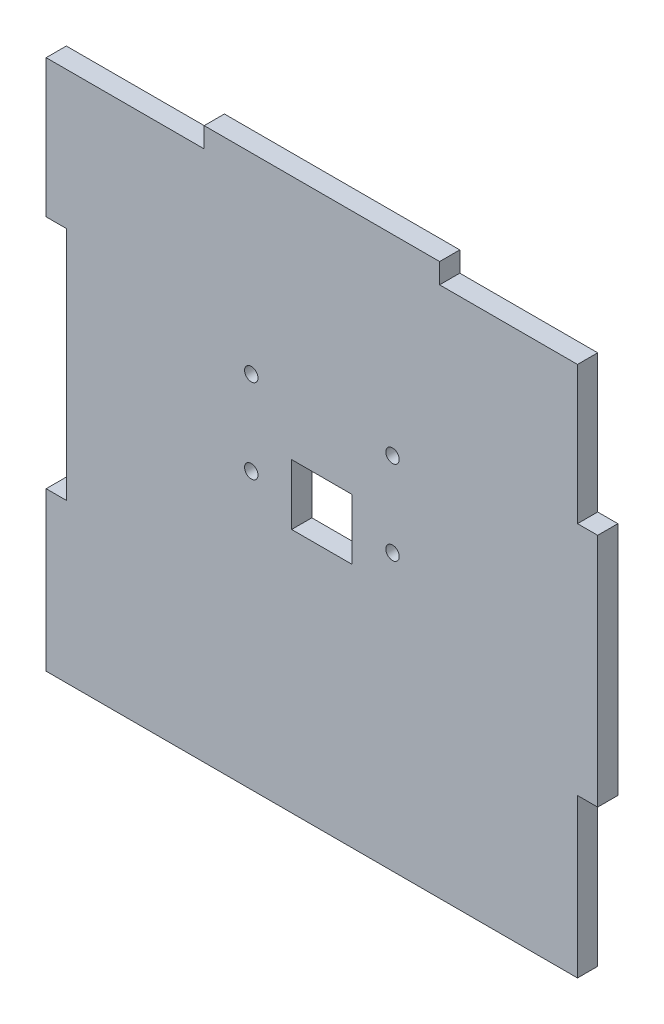
ISO-10303-21;
HEADER;
FILE_DESCRIPTION(('STEP AP214'),'2;1');
FILE_NAME('part.step','',(''),(''),'','','');
FILE_SCHEMA(('AUTOMOTIVE_DESIGN { 1 0 10303 214 1 1 1 1 }'));
ENDSEC;
DATA;
#1=APPLICATION_CONTEXT('core data for automotive mechanical design processes');
#2=APPLICATION_PROTOCOL_DEFINITION('international standard','automotive_design',2000,#1);
#3=PRODUCT_CONTEXT('',#1,'mechanical');
#4=PRODUCT('Part','Part','',(#3));
#5=PRODUCT_RELATED_PRODUCT_CATEGORY('part','',(#4));
#6=PRODUCT_DEFINITION_FORMATION('','',#4);
#7=PRODUCT_DEFINITION_CONTEXT('part definition',#1,'design');
#8=PRODUCT_DEFINITION('design','',#6,#7);
#9=PRODUCT_DEFINITION_SHAPE('','',#8);
#10=(LENGTH_UNIT() NAMED_UNIT(*) SI_UNIT(.MILLI.,.METRE.));
#11=(NAMED_UNIT(*) PLANE_ANGLE_UNIT() SI_UNIT($,.RADIAN.));
#12=(NAMED_UNIT(*) SI_UNIT($,.STERADIAN.) SOLID_ANGLE_UNIT());
#13=UNCERTAINTY_MEASURE_WITH_UNIT(LENGTH_MEASURE(1.E-05),#10,'distance_accuracy_value','');
#14=(GEOMETRIC_REPRESENTATION_CONTEXT(3) GLOBAL_UNCERTAINTY_ASSIGNED_CONTEXT((#13)) GLOBAL_UNIT_ASSIGNED_CONTEXT((#10,
#11,#12)) REPRESENTATION_CONTEXT('',''));
#15=CARTESIAN_POINT('',(0.,0.,0.));
#16=DIRECTION('',(0.,0.,1.));
#17=DIRECTION('',(1.,0.,0.));
#18=AXIS2_PLACEMENT_3D('',#15,#16,#17);
#19=CARTESIAN_POINT('',(38.,-16.,3.));
#20=DIRECTION('',(0.,1.,0.));
#21=DIRECTION('',(-1.,0.,0.));
#22=AXIS2_PLACEMENT_3D('',#19,#20,#21);
#23=PLANE('',#22);
#24=DIRECTION('',(1.,0.,0.));
#25=VECTOR('',#24,1.);
#26=CARTESIAN_POINT('',(38.,-16.,0.));
#27=LINE('',#26,#25);
#28=CARTESIAN_POINT('',(38.,-16.,0.));
#29=VERTEX_POINT('',#28);
#30=CARTESIAN_POINT('',(41.,-16.,0.));
#31=VERTEX_POINT('',#30);
#32=EDGE_CURVE('E246',#29,#31,#27,.T.);
#33=ORIENTED_EDGE('',*,*,#32,.T.);
#34=DIRECTION('',(0.,0.,-1.));
#35=VECTOR('',#34,1.);
#36=CARTESIAN_POINT('',(41.,-16.,3.));
#37=LINE('',#36,#35);
#38=CARTESIAN_POINT('',(41.,-16.,3.));
#39=VERTEX_POINT('',#38);
#40=EDGE_CURVE('E11',#39,#31,#37,.T.);
#41=ORIENTED_EDGE('',*,*,#40,.F.);
#42=DIRECTION('',(1.,0.,0.));
#43=VECTOR('',#42,1.);
#44=CARTESIAN_POINT('',(38.,-16.,3.));
#45=LINE('',#44,#43);
#46=CARTESIAN_POINT('',(38.,-16.,3.));
#47=VERTEX_POINT('',#46);
#48=EDGE_CURVE('E252',#47,#39,#45,.T.);
#49=ORIENTED_EDGE('',*,*,#48,.F.);
#50=DIRECTION('',(0.,0.,-1.));
#51=VECTOR('',#50,1.);
#52=CARTESIAN_POINT('',(38.,-16.,3.));
#53=LINE('',#52,#51);
#54=EDGE_CURVE('E302',#47,#29,#53,.T.);
#55=ORIENTED_EDGE('',*,*,#54,.T.);
#56=EDGE_LOOP('',(#33,#41,#49,#55));
#57=FACE_BOUND('',#56,.T.);
#58=ADVANCED_FACE('F38',(#57),#23,.F.);
#59=CARTESIAN_POINT('',(41.,16.,3.));
#60=DIRECTION('',(-1.,0.,0.));
#61=DIRECTION('',(0.,0.,1.));
#62=AXIS2_PLACEMENT_3D('',#59,#60,#61);
#63=PLANE('',#62);
#64=DIRECTION('',(0.,1.,0.));
#65=VECTOR('',#64,1.);
#66=CARTESIAN_POINT('',(41.,16.,0.));
#67=LINE('',#66,#65);
#68=CARTESIAN_POINT('',(41.,19.,0.));
#69=VERTEX_POINT('',#68);
#70=EDGE_CURVE('E306',#31,#69,#67,.T.);
#71=ORIENTED_EDGE('',*,*,#70,.T.);
#72=DIRECTION('',(0.,0.,-1.));
#73=VECTOR('',#72,1.);
#74=CARTESIAN_POINT('',(41.,19.,3.));
#75=LINE('',#74,#73);
#76=CARTESIAN_POINT('',(41.,19.,3.));
#77=VERTEX_POINT('',#76);
#78=EDGE_CURVE('E46',#77,#69,#75,.T.);
#79=ORIENTED_EDGE('',*,*,#78,.F.);
#80=DIRECTION('',(0.,1.,0.));
#81=VECTOR('',#80,1.);
#82=CARTESIAN_POINT('',(41.,16.,3.));
#83=LINE('',#82,#81);
#84=EDGE_CURVE('E256',#39,#77,#83,.T.);
#85=ORIENTED_EDGE('',*,*,#84,.F.);
#86=ORIENTED_EDGE('',*,*,#40,.T.);
#87=EDGE_LOOP('',(#71,#79,#85,#86));
#88=FACE_BOUND('',#87,.T.);
#89=ADVANCED_FACE('F436',(#88),#63,.F.);
#90=CARTESIAN_POINT('',(41.,19.,3.));
#91=DIRECTION('',(0.,-1.,0.));
#92=DIRECTION('',(0.,0.,-1.));
#93=AXIS2_PLACEMENT_3D('',#90,#91,#92);
#94=PLANE('',#93);
#95=DIRECTION('',(-1.,0.,0.));
#96=VECTOR('',#95,1.);
#97=CARTESIAN_POINT('',(41.,19.,0.));
#98=LINE('',#97,#96);
#99=CARTESIAN_POINT('',(38.,19.,0.));
#100=VERTEX_POINT('',#99);
#101=EDGE_CURVE('E309',#69,#100,#98,.T.);
#102=ORIENTED_EDGE('',*,*,#101,.T.);
#103=DIRECTION('',(0.,0.,-1.));
#104=VECTOR('',#103,1.);
#105=CARTESIAN_POINT('',(38.,19.,3.));
#106=LINE('',#105,#104);
#107=CARTESIAN_POINT('',(38.,19.,3.));
#108=VERTEX_POINT('',#107);
#109=EDGE_CURVE('E405',#108,#100,#106,.T.);
#110=ORIENTED_EDGE('',*,*,#109,.F.);
#111=DIRECTION('',(-1.,0.,0.));
#112=VECTOR('',#111,1.);
#113=CARTESIAN_POINT('',(41.,19.,3.));
#114=LINE('',#113,#112);
#115=EDGE_CURVE('E260',#77,#108,#114,.T.);
#116=ORIENTED_EDGE('',*,*,#115,.F.);
#117=ORIENTED_EDGE('',*,*,#78,.T.);
#118=EDGE_LOOP('',(#102,#110,#116,#117));
#119=FACE_BOUND('',#118,.T.);
#120=ADVANCED_FACE('F414',(#119),#94,.F.);
#121=CARTESIAN_POINT('',(38.,39.5,3.));
#122=DIRECTION('',(-1.,0.,0.));
#123=DIRECTION('',(0.,-1.,0.));
#124=AXIS2_PLACEMENT_3D('',#121,#122,#123);
#125=PLANE('',#124);
#126=DIRECTION('',(0.,1.,0.));
#127=VECTOR('',#126,1.);
#128=CARTESIAN_POINT('',(38.,39.5,0.));
#129=LINE('',#128,#127);
#130=CARTESIAN_POINT('',(38.,39.5,0.));
#131=VERTEX_POINT('',#130);
#132=EDGE_CURVE('E312',#100,#131,#129,.T.);
#133=ORIENTED_EDGE('',*,*,#132,.T.);
#134=DIRECTION('',(0.,0.,-1.));
#135=VECTOR('',#134,1.);
#136=CARTESIAN_POINT('',(38.,39.5,3.));
#137=LINE('',#136,#135);
#138=CARTESIAN_POINT('',(38.,39.5,3.));
#139=VERTEX_POINT('',#138);
#140=EDGE_CURVE('E401',#139,#131,#137,.T.);
#141=ORIENTED_EDGE('',*,*,#140,.F.);
#142=DIRECTION('',(0.,1.,0.));
#143=VECTOR('',#142,1.);
#144=CARTESIAN_POINT('',(38.,39.5,3.));
#145=LINE('',#144,#143);
#146=EDGE_CURVE('E263',#108,#139,#145,.T.);
#147=ORIENTED_EDGE('',*,*,#146,.F.);
#148=ORIENTED_EDGE('',*,*,#109,.T.);
#149=EDGE_LOOP('',(#133,#141,#147,#148));
#150=FACE_BOUND('',#149,.T.);
#151=ADVANCED_FACE('F424',(#150),#125,.F.);
#152=CARTESIAN_POINT('',(17.5,39.5,3.));
#153=DIRECTION('',(0.,-1.,0.));
#154=DIRECTION('',(1.,0.,0.));
#155=AXIS2_PLACEMENT_3D('',#152,#153,#154);
#156=PLANE('',#155);
#157=DIRECTION('',(-1.,0.,0.));
#158=VECTOR('',#157,1.);
#159=CARTESIAN_POINT('',(17.5,39.5,0.));
#160=LINE('',#159,#158);
#161=CARTESIAN_POINT('',(17.5,39.5,0.));
#162=VERTEX_POINT('',#161);
#163=EDGE_CURVE('E315',#131,#162,#160,.T.);
#164=ORIENTED_EDGE('',*,*,#163,.T.);
#165=DIRECTION('',(0.,0.,-1.));
#166=VECTOR('',#165,1.);
#167=CARTESIAN_POINT('',(17.5,39.5,3.));
#168=LINE('',#167,#166);
#169=CARTESIAN_POINT('',(17.5,39.5,3.));
#170=VERTEX_POINT('',#169);
#171=EDGE_CURVE('E397',#170,#162,#168,.T.);
#172=ORIENTED_EDGE('',*,*,#171,.F.);
#173=DIRECTION('',(-1.,0.,0.));
#174=VECTOR('',#173,1.);
#175=CARTESIAN_POINT('',(17.5,39.5,3.));
#176=LINE('',#175,#174);
#177=EDGE_CURVE('E266',#139,#170,#176,.T.);
#178=ORIENTED_EDGE('',*,*,#177,.F.);
#179=ORIENTED_EDGE('',*,*,#140,.T.);
#180=EDGE_LOOP('',(#164,#172,#178,#179));
#181=FACE_BOUND('',#180,.T.);
#182=ADVANCED_FACE('F428',(#181),#156,.F.);
#183=CARTESIAN_POINT('',(17.5,42.5,3.));
#184=DIRECTION('',(-1.,0.,0.));
#185=DIRECTION('',(0.,-1.,0.));
#186=AXIS2_PLACEMENT_3D('',#183,#184,#185);
#187=PLANE('',#186);
#188=DIRECTION('',(0.,1.,0.));
#189=VECTOR('',#188,1.);
#190=CARTESIAN_POINT('',(17.5,42.5,0.));
#191=LINE('',#190,#189);
#192=CARTESIAN_POINT('',(17.5,42.5,0.));
#193=VERTEX_POINT('',#192);
#194=EDGE_CURVE('E318',#162,#193,#191,.T.);
#195=ORIENTED_EDGE('',*,*,#194,.T.);
#196=DIRECTION('',(0.,0.,-1.));
#197=VECTOR('',#196,1.);
#198=CARTESIAN_POINT('',(17.5,42.5,3.));
#199=LINE('',#198,#197);
#200=CARTESIAN_POINT('',(17.5,42.5,3.));
#201=VERTEX_POINT('',#200);
#202=EDGE_CURVE('E393',#201,#193,#199,.T.);
#203=ORIENTED_EDGE('',*,*,#202,.F.);
#204=DIRECTION('',(0.,1.,0.));
#205=VECTOR('',#204,1.);
#206=CARTESIAN_POINT('',(17.5,42.5,3.));
#207=LINE('',#206,#205);
#208=EDGE_CURVE('E269',#170,#201,#207,.T.);
#209=ORIENTED_EDGE('',*,*,#208,.F.);
#210=ORIENTED_EDGE('',*,*,#171,.T.);
#211=EDGE_LOOP('',(#195,#203,#209,#210));
#212=FACE_BOUND('',#211,.T.);
#213=ADVANCED_FACE('F485',(#212),#187,.F.);
#214=CARTESIAN_POINT('',(-17.5,42.5,3.));
#215=DIRECTION('',(0.,-1.,0.));
#216=DIRECTION('',(0.,0.,-1.));
#217=AXIS2_PLACEMENT_3D('',#214,#215,#216);
#218=PLANE('',#217);
#219=DIRECTION('',(-1.,0.,0.));
#220=VECTOR('',#219,1.);
#221=CARTESIAN_POINT('',(-17.5,42.5,0.));
#222=LINE('',#221,#220);
#223=CARTESIAN_POINT('',(-17.5,42.5,0.));
#224=VERTEX_POINT('',#223);
#225=EDGE_CURVE('E321',#193,#224,#222,.T.);
#226=ORIENTED_EDGE('',*,*,#225,.T.);
#227=DIRECTION('',(0.,0.,-1.));
#228=VECTOR('',#227,1.);
#229=CARTESIAN_POINT('',(-17.5,42.5,3.));
#230=LINE('',#229,#228);
#231=CARTESIAN_POINT('',(-17.5,42.5,3.));
#232=VERTEX_POINT('',#231);
#233=EDGE_CURVE('E389',#232,#224,#230,.T.);
#234=ORIENTED_EDGE('',*,*,#233,.F.);
#235=DIRECTION('',(-1.,0.,0.));
#236=VECTOR('',#235,1.);
#237=CARTESIAN_POINT('',(-17.5,42.5,3.));
#238=LINE('',#237,#236);
#239=EDGE_CURVE('E272',#201,#232,#238,.T.);
#240=ORIENTED_EDGE('',*,*,#239,.F.);
#241=ORIENTED_EDGE('',*,*,#202,.T.);
#242=EDGE_LOOP('',(#226,#234,#240,#241));
#243=FACE_BOUND('',#242,.T.);
#244=ADVANCED_FACE('F483',(#243),#218,.F.);
#245=CARTESIAN_POINT('',(-17.5,39.5,3.));
#246=DIRECTION('',(1.,0.,0.));
#247=DIRECTION('',(0.,0.,-1.));
#248=AXIS2_PLACEMENT_3D('',#245,#246,#247);
#249=PLANE('',#248);
#250=DIRECTION('',(0.,-1.,0.));
#251=VECTOR('',#250,1.);
#252=CARTESIAN_POINT('',(-17.5,39.5,0.));
#253=LINE('',#252,#251);
#254=CARTESIAN_POINT('',(-17.5,39.5,0.));
#255=VERTEX_POINT('',#254);
#256=EDGE_CURVE('E324',#224,#255,#253,.T.);
#257=ORIENTED_EDGE('',*,*,#256,.T.);
#258=DIRECTION('',(0.,0.,-1.));
#259=VECTOR('',#258,1.);
#260=CARTESIAN_POINT('',(-17.5,39.5,3.));
#261=LINE('',#260,#259);
#262=CARTESIAN_POINT('',(-17.5,39.5,3.));
#263=VERTEX_POINT('',#262);
#264=EDGE_CURVE('E385',#263,#255,#261,.T.);
#265=ORIENTED_EDGE('',*,*,#264,.F.);
#266=DIRECTION('',(0.,-1.,0.));
#267=VECTOR('',#266,1.);
#268=CARTESIAN_POINT('',(-17.5,39.5,3.));
#269=LINE('',#268,#267);
#270=EDGE_CURVE('E275',#232,#263,#269,.T.);
#271=ORIENTED_EDGE('',*,*,#270,.F.);
#272=ORIENTED_EDGE('',*,*,#233,.T.);
#273=EDGE_LOOP('',(#257,#265,#271,#272));
#274=FACE_BOUND('',#273,.T.);
#275=ADVANCED_FACE('F476',(#274),#249,.F.);
#276=CARTESIAN_POINT('',(-41.,39.5,3.));
#277=DIRECTION('',(0.,-1.,0.));
#278=DIRECTION('',(0.,0.,-1.));
#279=AXIS2_PLACEMENT_3D('',#276,#277,#278);
#280=PLANE('',#279);
#281=DIRECTION('',(-1.,0.,0.));
#282=VECTOR('',#281,1.);
#283=CARTESIAN_POINT('',(-41.,39.5,0.));
#284=LINE('',#283,#282);
#285=CARTESIAN_POINT('',(-41.,39.5,0.));
#286=VERTEX_POINT('',#285);
#287=EDGE_CURVE('E328',#255,#286,#284,.T.);
#288=ORIENTED_EDGE('',*,*,#287,.T.);
#289=DIRECTION('',(0.,0.,-1.));
#290=VECTOR('',#289,1.);
#291=CARTESIAN_POINT('',(-41.,39.5,3.));
#292=LINE('',#291,#290);
#293=CARTESIAN_POINT('',(-41.,39.5,3.));
#294=VERTEX_POINT('',#293);
#295=EDGE_CURVE('E381',#294,#286,#292,.T.);
#296=ORIENTED_EDGE('',*,*,#295,.F.);
#297=DIRECTION('',(-1.,0.,0.));
#298=VECTOR('',#297,1.);
#299=CARTESIAN_POINT('',(-38.,39.5,3.));
#300=LINE('',#299,#298);
#301=EDGE_CURVE('E278',#263,#294,#300,.T.);
#302=ORIENTED_EDGE('',*,*,#301,.F.);
#303=ORIENTED_EDGE('',*,*,#264,.T.);
#304=EDGE_LOOP('',(#288,#296,#302,#303));
#305=FACE_BOUND('',#304,.T.);
#306=ADVANCED_FACE('F480',(#305),#280,.F.);
#307=CARTESIAN_POINT('',(-41.,19.,3.));
#308=DIRECTION('',(1.,0.,0.));
#309=DIRECTION('',(0.,1.,0.));
#310=AXIS2_PLACEMENT_3D('',#307,#308,#309);
#311=PLANE('',#310);
#312=DIRECTION('',(0.,-1.,0.));
#313=VECTOR('',#312,1.);
#314=CARTESIAN_POINT('',(-41.,19.,0.));
#315=LINE('',#314,#313);
#316=CARTESIAN_POINT('',(-41.,19.,0.));
#317=VERTEX_POINT('',#316);
#318=EDGE_CURVE('E331',#286,#317,#315,.T.);
#319=ORIENTED_EDGE('',*,*,#318,.T.);
#320=DIRECTION('',(0.,0.,-1.));
#321=VECTOR('',#320,1.);
#322=CARTESIAN_POINT('',(-41.,19.,3.));
#323=LINE('',#322,#321);
#324=CARTESIAN_POINT('',(-41.,19.,3.));
#325=VERTEX_POINT('',#324);
#326=EDGE_CURVE('E377',#325,#317,#323,.T.);
#327=ORIENTED_EDGE('',*,*,#326,.F.);
#328=DIRECTION('',(0.,-1.,0.));
#329=VECTOR('',#328,1.);
#330=CARTESIAN_POINT('',(-41.,19.,3.));
#331=LINE('',#330,#329);
#332=EDGE_CURVE('E281',#294,#325,#331,.T.);
#333=ORIENTED_EDGE('',*,*,#332,.F.);
#334=ORIENTED_EDGE('',*,*,#295,.T.);
#335=EDGE_LOOP('',(#319,#327,#333,#334));
#336=FACE_BOUND('',#335,.T.);
#337=ADVANCED_FACE('F469',(#336),#311,.F.);
#338=CARTESIAN_POINT('',(-38.,19.,3.));
#339=DIRECTION('',(0.,1.,0.));
#340=DIRECTION('',(-1.,0.,0.));
#341=AXIS2_PLACEMENT_3D('',#338,#339,#340);
#342=PLANE('',#341);
#343=DIRECTION('',(1.,0.,0.));
#344=VECTOR('',#343,1.);
#345=CARTESIAN_POINT('',(-38.,19.,0.));
#346=LINE('',#345,#344);
#347=CARTESIAN_POINT('',(-38.,19.,0.));
#348=VERTEX_POINT('',#347);
#349=EDGE_CURVE('E334',#317,#348,#346,.T.);
#350=ORIENTED_EDGE('',*,*,#349,.T.);
#351=DIRECTION('',(0.,0.,-1.));
#352=VECTOR('',#351,1.);
#353=CARTESIAN_POINT('',(-38.,19.,3.));
#354=LINE('',#353,#352);
#355=CARTESIAN_POINT('',(-38.,19.,3.));
#356=VERTEX_POINT('',#355);
#357=EDGE_CURVE('E373',#356,#348,#354,.T.);
#358=ORIENTED_EDGE('',*,*,#357,.F.);
#359=DIRECTION('',(1.,0.,0.));
#360=VECTOR('',#359,1.);
#361=CARTESIAN_POINT('',(-38.,19.,3.));
#362=LINE('',#361,#360);
#363=EDGE_CURVE('E284',#325,#356,#362,.T.);
#364=ORIENTED_EDGE('',*,*,#363,.F.);
#365=ORIENTED_EDGE('',*,*,#326,.T.);
#366=EDGE_LOOP('',(#350,#358,#364,#365));
#367=FACE_BOUND('',#366,.T.);
#368=ADVANCED_FACE('F464',(#367),#342,.F.);
#369=CARTESIAN_POINT('',(-38.,16.,3.));
#370=DIRECTION('',(1.,0.,0.));
#371=DIRECTION('',(0.,0.,-1.));
#372=AXIS2_PLACEMENT_3D('',#369,#370,#371);
#373=PLANE('',#372);
#374=DIRECTION('',(0.,-1.,0.));
#375=VECTOR('',#374,1.);
#376=CARTESIAN_POINT('',(-38.,16.,0.));
#377=LINE('',#376,#375);
#378=CARTESIAN_POINT('',(-38.,-16.,0.));
#379=VERTEX_POINT('',#378);
#380=EDGE_CURVE('E338',#348,#379,#377,.T.);
#381=ORIENTED_EDGE('',*,*,#380,.T.);
#382=DIRECTION('',(0.,0.,-1.));
#383=VECTOR('',#382,1.);
#384=CARTESIAN_POINT('',(-38.,-16.,3.));
#385=LINE('',#384,#383);
#386=CARTESIAN_POINT('',(-38.,-16.,3.));
#387=VERTEX_POINT('',#386);
#388=EDGE_CURVE('E369',#387,#379,#385,.T.);
#389=ORIENTED_EDGE('',*,*,#388,.F.);
#390=DIRECTION('',(0.,-1.,0.));
#391=VECTOR('',#390,1.);
#392=CARTESIAN_POINT('',(-38.,16.,3.));
#393=LINE('',#392,#391);
#394=EDGE_CURVE('E287',#356,#387,#393,.T.);
#395=ORIENTED_EDGE('',*,*,#394,.F.);
#396=ORIENTED_EDGE('',*,*,#357,.T.);
#397=EDGE_LOOP('',(#381,#389,#395,#396));
#398=FACE_BOUND('',#397,.T.);
#399=ADVANCED_FACE('F459',(#398),#373,.F.);
#400=CARTESIAN_POINT('',(-41.,-16.,3.));
#401=DIRECTION('',(0.,-1.,0.));
#402=DIRECTION('',(0.,0.,-1.));
#403=AXIS2_PLACEMENT_3D('',#400,#401,#402);
#404=PLANE('',#403);
#405=DIRECTION('',(-1.,0.,0.));
#406=VECTOR('',#405,1.);
#407=CARTESIAN_POINT('',(-41.,-16.,0.));
#408=LINE('',#407,#406);
#409=CARTESIAN_POINT('',(-41.,-16.,0.));
#410=VERTEX_POINT('',#409);
#411=EDGE_CURVE('E341',#379,#410,#408,.T.);
#412=ORIENTED_EDGE('',*,*,#411,.T.);
#413=DIRECTION('',(0.,0.,-1.));
#414=VECTOR('',#413,1.);
#415=CARTESIAN_POINT('',(-41.,-16.,3.));
#416=LINE('',#415,#414);
#417=CARTESIAN_POINT('',(-41.,-16.,3.));
#418=VERTEX_POINT('',#417);
#419=EDGE_CURVE('E365',#418,#410,#416,.T.);
#420=ORIENTED_EDGE('',*,*,#419,.F.);
#421=DIRECTION('',(-1.,0.,0.));
#422=VECTOR('',#421,1.);
#423=CARTESIAN_POINT('',(-41.,-16.,3.));
#424=LINE('',#423,#422);
#425=EDGE_CURVE('E290',#387,#418,#424,.T.);
#426=ORIENTED_EDGE('',*,*,#425,.F.);
#427=ORIENTED_EDGE('',*,*,#388,.T.);
#428=EDGE_LOOP('',(#412,#420,#426,#427));
#429=FACE_BOUND('',#428,.T.);
#430=ADVANCED_FACE('F455',(#429),#404,.F.);
#431=CARTESIAN_POINT('',(-41.,-19.,3.));
#432=DIRECTION('',(1.,0.,0.));
#433=DIRECTION('',(0.,1.,0.));
#434=AXIS2_PLACEMENT_3D('',#431,#432,#433);
#435=PLANE('',#434);
#436=DIRECTION('',(0.,-1.,0.));
#437=VECTOR('',#436,1.);
#438=CARTESIAN_POINT('',(-41.,-19.,0.));
#439=LINE('',#438,#437);
#440=CARTESIAN_POINT('',(-41.,-39.5,0.));
#441=VERTEX_POINT('',#440);
#442=EDGE_CURVE('E345',#410,#441,#439,.T.);
#443=ORIENTED_EDGE('',*,*,#442,.T.);
#444=DIRECTION('',(0.,0.,-1.));
#445=VECTOR('',#444,1.);
#446=CARTESIAN_POINT('',(-41.,-39.5,3.));
#447=LINE('',#446,#445);
#448=CARTESIAN_POINT('',(-41.,-39.5,3.));
#449=VERTEX_POINT('',#448);
#450=EDGE_CURVE('E361',#449,#441,#447,.T.);
#451=ORIENTED_EDGE('',*,*,#450,.F.);
#452=DIRECTION('',(0.,-1.,0.));
#453=VECTOR('',#452,1.);
#454=CARTESIAN_POINT('',(-41.,-19.,3.));
#455=LINE('',#454,#453);
#456=EDGE_CURVE('E293',#418,#449,#455,.T.);
#457=ORIENTED_EDGE('',*,*,#456,.F.);
#458=ORIENTED_EDGE('',*,*,#419,.T.);
#459=EDGE_LOOP('',(#443,#451,#457,#458));
#460=FACE_BOUND('',#459,.T.);
#461=ADVANCED_FACE('F452',(#460),#435,.F.);
#462=CARTESIAN_POINT('',(-41.,-39.5,3.));
#463=DIRECTION('',(0.,1.,0.));
#464=DIRECTION('',(0.,0.,1.));
#465=AXIS2_PLACEMENT_3D('',#462,#463,#464);
#466=PLANE('',#465);
#467=DIRECTION('',(1.,0.,0.));
#468=VECTOR('',#467,1.);
#469=CARTESIAN_POINT('',(-41.,-39.5,0.));
#470=LINE('',#469,#468);
#471=CARTESIAN_POINT('',(38.,-39.5,0.));
#472=VERTEX_POINT('',#471);
#473=EDGE_CURVE('E348',#441,#472,#470,.T.);
#474=ORIENTED_EDGE('',*,*,#473,.T.);
#475=DIRECTION('',(0.,0.,-1.));
#476=VECTOR('',#475,1.);
#477=CARTESIAN_POINT('',(38.,-39.5,3.));
#478=LINE('',#477,#476);
#479=CARTESIAN_POINT('',(38.,-39.5,3.));
#480=VERTEX_POINT('',#479);
#481=EDGE_CURVE('E357',#480,#472,#478,.T.);
#482=ORIENTED_EDGE('',*,*,#481,.F.);
#483=DIRECTION('',(1.,0.,0.));
#484=VECTOR('',#483,1.);
#485=CARTESIAN_POINT('',(-41.,-39.5,3.));
#486=LINE('',#485,#484);
#487=EDGE_CURVE('E296',#449,#480,#486,.T.);
#488=ORIENTED_EDGE('',*,*,#487,.F.);
#489=ORIENTED_EDGE('',*,*,#450,.T.);
#490=EDGE_LOOP('',(#474,#482,#488,#489));
#491=FACE_BOUND('',#490,.T.);
#492=ADVANCED_FACE('F443',(#491),#466,.F.);
#493=CARTESIAN_POINT('',(38.,-19.,3.));
#494=DIRECTION('',(-1.,0.,0.));
#495=DIRECTION('',(0.,-1.,0.));
#496=AXIS2_PLACEMENT_3D('',#493,#494,#495);
#497=PLANE('',#496);
#498=DIRECTION('',(0.,1.,0.));
#499=VECTOR('',#498,1.);
#500=CARTESIAN_POINT('',(38.,-19.,0.));
#501=LINE('',#500,#499);
#502=EDGE_CURVE('E257',#472,#29,#501,.T.);
#503=ORIENTED_EDGE('',*,*,#502,.T.);
#504=ORIENTED_EDGE('',*,*,#54,.F.);
#505=DIRECTION('',(0.,1.,0.));
#506=VECTOR('',#505,1.);
#507=CARTESIAN_POINT('',(38.,-19.,3.));
#508=LINE('',#507,#506);
#509=EDGE_CURVE('E299',#480,#47,#508,.T.);
#510=ORIENTED_EDGE('',*,*,#509,.F.);
#511=ORIENTED_EDGE('',*,*,#481,.T.);
#512=EDGE_LOOP('',(#503,#504,#510,#511));
#513=FACE_BOUND('',#512,.T.);
#514=ADVANCED_FACE('F447',(#513),#497,.F.);
#515=CARTESIAN_POINT('',(0.,0.,3.));
#516=DIRECTION('',(0.,0.,-1.));
#517=DIRECTION('',(-1.,0.,0.));
#518=AXIS2_PLACEMENT_3D('',#515,#516,#517);
#519=PLANE('',#518);
#520=CARTESIAN_POINT('',(10.5,14.,3.));
#521=DIRECTION('',(0.,0.,1.));
#522=DIRECTION('',(-1.,0.,0.));
#523=AXIS2_PLACEMENT_3D('',#520,#521,#522);
#524=CIRCLE('',#523,1.);
#525=CARTESIAN_POINT('',(9.5,14.,3.));
#526=VERTEX_POINT('',#525);
#527=EDGE_CURVE('E238',#526,#526,#524,.T.);
#528=ORIENTED_EDGE('',*,*,#527,.F.);
#529=EDGE_LOOP('',(#528));
#530=FACE_BOUND('',#529,.T.);
#531=CARTESIAN_POINT('',(10.5,1.5,3.));
#532=DIRECTION('',(0.,0.,1.));
#533=DIRECTION('',(-1.,0.,0.));
#534=AXIS2_PLACEMENT_3D('',#531,#532,#533);
#535=CIRCLE('',#534,1.);
#536=CARTESIAN_POINT('',(9.5,1.5,3.));
#537=VERTEX_POINT('',#536);
#538=EDGE_CURVE('E230',#537,#537,#535,.T.);
#539=ORIENTED_EDGE('',*,*,#538,.F.);
#540=EDGE_LOOP('',(#539));
#541=FACE_BOUND('',#540,.T.);
#542=DIRECTION('',(-1.,0.,0.));
#543=VECTOR('',#542,1.);
#544=CARTESIAN_POINT('',(-4.5,6.,3.));
#545=LINE('',#544,#543);
#546=CARTESIAN_POINT('',(4.5,6.,3.));
#547=VERTEX_POINT('',#546);
#548=CARTESIAN_POINT('',(-4.5,6.,3.));
#549=VERTEX_POINT('',#548);
#550=EDGE_CURVE('E212',#547,#549,#545,.T.);
#551=ORIENTED_EDGE('',*,*,#550,.F.);
#552=DIRECTION('',(0.,1.,0.));
#553=VECTOR('',#552,1.);
#554=CARTESIAN_POINT('',(4.5,-3.,3.));
#555=LINE('',#554,#553);
#556=CARTESIAN_POINT('',(4.5,-3.,3.));
#557=VERTEX_POINT('',#556);
#558=EDGE_CURVE('E53',#557,#547,#555,.T.);
#559=ORIENTED_EDGE('',*,*,#558,.F.);
#560=DIRECTION('',(1.,0.,0.));
#561=VECTOR('',#560,1.);
#562=CARTESIAN_POINT('',(-4.5,-3.,3.));
#563=LINE('',#562,#561);
#564=CARTESIAN_POINT('',(-4.5,-3.,3.));
#565=VERTEX_POINT('',#564);
#566=EDGE_CURVE('E196',#565,#557,#563,.T.);
#567=ORIENTED_EDGE('',*,*,#566,.F.);
#568=DIRECTION('',(0.,-1.,0.));
#569=VECTOR('',#568,1.);
#570=CARTESIAN_POINT('',(-4.5,-3.,3.));
#571=LINE('',#570,#569);
#572=EDGE_CURVE('E200',#549,#565,#571,.T.);
#573=ORIENTED_EDGE('',*,*,#572,.F.);
#574=EDGE_LOOP('',(#551,#559,#567,#573));
#575=FACE_BOUND('',#574,.T.);
#576=CARTESIAN_POINT('',(-10.5,1.5,3.));
#577=DIRECTION('',(0.,0.,1.));
#578=DIRECTION('',(1.,0.,0.));
#579=AXIS2_PLACEMENT_3D('',#576,#577,#578);
#580=CIRCLE('',#579,1.);
#581=CARTESIAN_POINT('',(-9.5,1.5,3.));
#582=VERTEX_POINT('',#581);
#583=EDGE_CURVE('E203',#582,#582,#580,.T.);
#584=ORIENTED_EDGE('',*,*,#583,.F.);
#585=EDGE_LOOP('',(#584));
#586=FACE_BOUND('',#585,.T.);
#587=CARTESIAN_POINT('',(-10.5,14.,3.));
#588=DIRECTION('',(0.,0.,1.));
#589=DIRECTION('',(1.,0.,0.));
#590=AXIS2_PLACEMENT_3D('',#587,#588,#589);
#591=CIRCLE('',#590,1.);
#592=CARTESIAN_POINT('',(-9.5,14.,3.));
#593=VERTEX_POINT('',#592);
#594=EDGE_CURVE('E247',#593,#593,#591,.T.);
#595=ORIENTED_EDGE('',*,*,#594,.F.);
#596=EDGE_LOOP('',(#595));
#597=FACE_BOUND('',#596,.T.);
#598=ORIENTED_EDGE('',*,*,#48,.T.);
#599=ORIENTED_EDGE('',*,*,#84,.T.);
#600=ORIENTED_EDGE('',*,*,#115,.T.);
#601=ORIENTED_EDGE('',*,*,#146,.T.);
#602=ORIENTED_EDGE('',*,*,#177,.T.);
#603=ORIENTED_EDGE('',*,*,#208,.T.);
#604=ORIENTED_EDGE('',*,*,#239,.T.);
#605=ORIENTED_EDGE('',*,*,#270,.T.);
#606=ORIENTED_EDGE('',*,*,#301,.T.);
#607=ORIENTED_EDGE('',*,*,#332,.T.);
#608=ORIENTED_EDGE('',*,*,#363,.T.);
#609=ORIENTED_EDGE('',*,*,#394,.T.);
#610=ORIENTED_EDGE('',*,*,#425,.T.);
#611=ORIENTED_EDGE('',*,*,#456,.T.);
#612=ORIENTED_EDGE('',*,*,#487,.T.);
#613=ORIENTED_EDGE('',*,*,#509,.T.);
#614=EDGE_LOOP('',(#598,#599,#600,#601,#602,#603,#604,#605,#606,#607,#608,#609,#610,#611,#612,#613));
#615=FACE_BOUND('',#614,.T.);
#616=ADVANCED_FACE('F432',(#530,#541,#575,#586,#597,#615),#519,.F.);
#617=CARTESIAN_POINT('',(0.,0.,0.));
#618=DIRECTION('',(0.,0.,-1.));
#619=DIRECTION('',(-1.,0.,0.));
#620=AXIS2_PLACEMENT_3D('',#617,#618,#619);
#621=PLANE('',#620);
#622=CARTESIAN_POINT('',(10.5,14.,0.));
#623=DIRECTION('',(0.,0.,1.));
#624=DIRECTION('',(-1.,0.,0.));
#625=AXIS2_PLACEMENT_3D('',#622,#623,#624);
#626=CIRCLE('',#625,1.);
#627=CARTESIAN_POINT('',(9.5,14.,0.));
#628=VERTEX_POINT('',#627);
#629=EDGE_CURVE('E234',#628,#628,#626,.T.);
#630=ORIENTED_EDGE('',*,*,#629,.T.);
#631=EDGE_LOOP('',(#630));
#632=FACE_BOUND('',#631,.T.);
#633=CARTESIAN_POINT('',(10.5,1.5,0.));
#634=DIRECTION('',(0.,0.,1.));
#635=DIRECTION('',(-1.,0.,0.));
#636=AXIS2_PLACEMENT_3D('',#633,#634,#635);
#637=CIRCLE('',#636,1.);
#638=CARTESIAN_POINT('',(9.5,1.5,0.));
#639=VERTEX_POINT('',#638);
#640=EDGE_CURVE('E213',#639,#639,#637,.T.);
#641=ORIENTED_EDGE('',*,*,#640,.T.);
#642=EDGE_LOOP('',(#641));
#643=FACE_BOUND('',#642,.T.);
#644=DIRECTION('',(0.,1.,0.));
#645=VECTOR('',#644,1.);
#646=CARTESIAN_POINT('',(4.5,-3.,0.));
#647=LINE('',#646,#645);
#648=CARTESIAN_POINT('',(4.5,-3.,0.));
#649=VERTEX_POINT('',#648);
#650=CARTESIAN_POINT('',(4.5,6.,0.));
#651=VERTEX_POINT('',#650);
#652=EDGE_CURVE('E177',#649,#651,#647,.T.);
#653=ORIENTED_EDGE('',*,*,#652,.T.);
#654=DIRECTION('',(-1.,0.,0.));
#655=VECTOR('',#654,1.);
#656=CARTESIAN_POINT('',(-4.5,6.,0.));
#657=LINE('',#656,#655);
#658=CARTESIAN_POINT('',(-4.5,6.,0.));
#659=VERTEX_POINT('',#658);
#660=EDGE_CURVE('E187',#651,#659,#657,.T.);
#661=ORIENTED_EDGE('',*,*,#660,.T.);
#662=DIRECTION('',(0.,-1.,0.));
#663=VECTOR('',#662,1.);
#664=CARTESIAN_POINT('',(-4.5,-3.,0.));
#665=LINE('',#664,#663);
#666=CARTESIAN_POINT('',(-4.5,-3.,0.));
#667=VERTEX_POINT('',#666);
#668=EDGE_CURVE('E61',#659,#667,#665,.T.);
#669=ORIENTED_EDGE('',*,*,#668,.T.);
#670=DIRECTION('',(1.,0.,0.));
#671=VECTOR('',#670,1.);
#672=CARTESIAN_POINT('',(-4.5,-3.,0.));
#673=LINE('',#672,#671);
#674=EDGE_CURVE('E184',#667,#649,#673,.T.);
#675=ORIENTED_EDGE('',*,*,#674,.T.);
#676=EDGE_LOOP('',(#653,#661,#669,#675));
#677=FACE_BOUND('',#676,.T.);
#678=CARTESIAN_POINT('',(-10.5,1.5,0.));
#679=DIRECTION('',(0.,0.,1.));
#680=DIRECTION('',(1.,0.,0.));
#681=AXIS2_PLACEMENT_3D('',#678,#679,#680);
#682=CIRCLE('',#681,1.);
#683=CARTESIAN_POINT('',(-9.5,1.5,0.));
#684=VERTEX_POINT('',#683);
#685=EDGE_CURVE('E251',#684,#684,#682,.T.);
#686=ORIENTED_EDGE('',*,*,#685,.T.);
#687=EDGE_LOOP('',(#686));
#688=FACE_BOUND('',#687,.T.);
#689=CARTESIAN_POINT('',(-10.5,14.,0.));
#690=DIRECTION('',(0.,0.,1.));
#691=DIRECTION('',(1.,0.,0.));
#692=AXIS2_PLACEMENT_3D('',#689,#690,#691);
#693=CIRCLE('',#692,1.);
#694=CARTESIAN_POINT('',(-9.5,14.,0.));
#695=VERTEX_POINT('',#694);
#696=EDGE_CURVE('E242',#695,#695,#693,.T.);
#697=ORIENTED_EDGE('',*,*,#696,.T.);
#698=EDGE_LOOP('',(#697));
#699=FACE_BOUND('',#698,.T.);
#700=ORIENTED_EDGE('',*,*,#32,.F.);
#701=ORIENTED_EDGE('',*,*,#502,.F.);
#702=ORIENTED_EDGE('',*,*,#473,.F.);
#703=ORIENTED_EDGE('',*,*,#442,.F.);
#704=ORIENTED_EDGE('',*,*,#411,.F.);
#705=ORIENTED_EDGE('',*,*,#380,.F.);
#706=ORIENTED_EDGE('',*,*,#349,.F.);
#707=ORIENTED_EDGE('',*,*,#318,.F.);
#708=ORIENTED_EDGE('',*,*,#287,.F.);
#709=ORIENTED_EDGE('',*,*,#256,.F.);
#710=ORIENTED_EDGE('',*,*,#225,.F.);
#711=ORIENTED_EDGE('',*,*,#194,.F.);
#712=ORIENTED_EDGE('',*,*,#163,.F.);
#713=ORIENTED_EDGE('',*,*,#132,.F.);
#714=ORIENTED_EDGE('',*,*,#101,.F.);
#715=ORIENTED_EDGE('',*,*,#70,.F.);
#716=EDGE_LOOP('',(#700,#701,#702,#703,#704,#705,#706,#707,#708,#709,#710,#711,#712,#713,#714,#715));
#717=FACE_BOUND('',#716,.T.);
#718=ADVANCED_FACE('F192',(#632,#643,#677,#688,#699,#717),#621,.T.);
#719=CARTESIAN_POINT('',(-10.5,14.,0.));
#720=DIRECTION('',(0.,0.,1.));
#721=DIRECTION('',(1.,0.,0.));
#722=AXIS2_PLACEMENT_3D('',#719,#720,#721);
#723=CYLINDRICAL_SURFACE('',#722,1.);
#724=ORIENTED_EDGE('',*,*,#696,.F.);
#725=EDGE_LOOP('',(#724));
#726=FACE_BOUND('',#725,.T.);
#727=ORIENTED_EDGE('',*,*,#594,.T.);
#728=EDGE_LOOP('',(#727));
#729=FACE_BOUND('',#728,.T.);
#730=ADVANCED_FACE('F616',(#726,#729),#723,.F.);
#731=CARTESIAN_POINT('',(-10.5,1.5,0.));
#732=DIRECTION('',(0.,0.,1.));
#733=DIRECTION('',(1.,0.,0.));
#734=AXIS2_PLACEMENT_3D('',#731,#732,#733);
#735=CYLINDRICAL_SURFACE('',#734,1.);
#736=ORIENTED_EDGE('',*,*,#685,.F.);
#737=EDGE_LOOP('',(#736));
#738=FACE_BOUND('',#737,.T.);
#739=ORIENTED_EDGE('',*,*,#583,.T.);
#740=EDGE_LOOP('',(#739));
#741=FACE_BOUND('',#740,.T.);
#742=ADVANCED_FACE('F626',(#738,#741),#735,.F.);
#743=CARTESIAN_POINT('',(4.5,-3.,0.));
#744=DIRECTION('',(1.,0.,0.));
#745=DIRECTION('',(0.,0.,-1.));
#746=AXIS2_PLACEMENT_3D('',#743,#744,#745);
#747=PLANE('',#746);
#748=ORIENTED_EDGE('',*,*,#558,.T.);
#749=DIRECTION('',(0.,0.,1.));
#750=VECTOR('',#749,1.);
#751=CARTESIAN_POINT('',(4.5,6.,0.));
#752=LINE('',#751,#750);
#753=EDGE_CURVE('E173',#651,#547,#752,.T.);
#754=ORIENTED_EDGE('',*,*,#753,.F.);
#755=ORIENTED_EDGE('',*,*,#652,.F.);
#756=DIRECTION('',(0.,0.,1.));
#757=VECTOR('',#756,1.);
#758=CARTESIAN_POINT('',(4.5,-3.,0.));
#759=LINE('',#758,#757);
#760=EDGE_CURVE('E219',#649,#557,#759,.T.);
#761=ORIENTED_EDGE('',*,*,#760,.T.);
#762=EDGE_LOOP('',(#748,#754,#755,#761));
#763=FACE_BOUND('',#762,.T.);
#764=ADVANCED_FACE('F175',(#763),#747,.F.);
#765=CARTESIAN_POINT('',(-4.5,-3.,0.));
#766=DIRECTION('',(0.,-1.,0.));
#767=DIRECTION('',(0.,0.,-1.));
#768=AXIS2_PLACEMENT_3D('',#765,#766,#767);
#769=PLANE('',#768);
#770=ORIENTED_EDGE('',*,*,#566,.T.);
#771=ORIENTED_EDGE('',*,*,#760,.F.);
#772=ORIENTED_EDGE('',*,*,#674,.F.);
#773=DIRECTION('',(0.,0.,1.));
#774=VECTOR('',#773,1.);
#775=CARTESIAN_POINT('',(-4.5,-3.,0.));
#776=LINE('',#775,#774);
#777=EDGE_CURVE('E222',#667,#565,#776,.T.);
#778=ORIENTED_EDGE('',*,*,#777,.T.);
#779=EDGE_LOOP('',(#770,#771,#772,#778));
#780=FACE_BOUND('',#779,.T.);
#781=ADVANCED_FACE('F645',(#780),#769,.F.);
#782=CARTESIAN_POINT('',(-4.5,-3.,0.));
#783=DIRECTION('',(-1.,0.,0.));
#784=DIRECTION('',(0.,0.,1.));
#785=AXIS2_PLACEMENT_3D('',#782,#783,#784);
#786=PLANE('',#785);
#787=ORIENTED_EDGE('',*,*,#572,.T.);
#788=ORIENTED_EDGE('',*,*,#777,.F.);
#789=ORIENTED_EDGE('',*,*,#668,.F.);
#790=DIRECTION('',(0.,0.,1.));
#791=VECTOR('',#790,1.);
#792=CARTESIAN_POINT('',(-4.5,6.,0.));
#793=LINE('',#792,#791);
#794=EDGE_CURVE('E183',#659,#549,#793,.T.);
#795=ORIENTED_EDGE('',*,*,#794,.T.);
#796=EDGE_LOOP('',(#787,#788,#789,#795));
#797=FACE_BOUND('',#796,.T.);
#798=ADVANCED_FACE('F654',(#797),#786,.F.);
#799=CARTESIAN_POINT('',(-4.5,6.,0.));
#800=DIRECTION('',(0.,1.,0.));
#801=DIRECTION('',(0.,0.,1.));
#802=AXIS2_PLACEMENT_3D('',#799,#800,#801);
#803=PLANE('',#802);
#804=ORIENTED_EDGE('',*,*,#550,.T.);
#805=ORIENTED_EDGE('',*,*,#794,.F.);
#806=ORIENTED_EDGE('',*,*,#660,.F.);
#807=ORIENTED_EDGE('',*,*,#753,.T.);
#808=EDGE_LOOP('',(#804,#805,#806,#807));
#809=FACE_BOUND('',#808,.T.);
#810=ADVANCED_FACE('F188',(#809),#803,.F.);
#811=CARTESIAN_POINT('',(10.5,1.5,0.));
#812=DIRECTION('',(0.,0.,1.));
#813=DIRECTION('',(1.,0.,0.));
#814=AXIS2_PLACEMENT_3D('',#811,#812,#813);
#815=CYLINDRICAL_SURFACE('',#814,1.);
#816=ORIENTED_EDGE('',*,*,#640,.F.);
#817=EDGE_LOOP('',(#816));
#818=FACE_BOUND('',#817,.T.);
#819=ORIENTED_EDGE('',*,*,#538,.T.);
#820=EDGE_LOOP('',(#819));
#821=FACE_BOUND('',#820,.T.);
#822=ADVANCED_FACE('F672',(#818,#821),#815,.F.);
#823=CARTESIAN_POINT('',(10.5,14.,0.));
#824=DIRECTION('',(0.,0.,1.));
#825=DIRECTION('',(1.,0.,0.));
#826=AXIS2_PLACEMENT_3D('',#823,#824,#825);
#827=CYLINDRICAL_SURFACE('',#826,1.);
#828=ORIENTED_EDGE('',*,*,#629,.F.);
#829=EDGE_LOOP('',(#828));
#830=FACE_BOUND('',#829,.T.);
#831=ORIENTED_EDGE('',*,*,#527,.T.);
#832=EDGE_LOOP('',(#831));
#833=FACE_BOUND('',#832,.T.);
#834=ADVANCED_FACE('F681',(#830,#833),#827,.F.);
#835=CLOSED_SHELL('',(#58,#89,#120,#151,#182,#213,#244,#275,#306,#337,#368,#399,#430,#461,#492,
#514,#616,#718,#730,#742,#764,#781,#798,#810,#822,#834));
#836=MANIFOLD_SOLID_BREP('B2',#835);
#837=ADVANCED_BREP_SHAPE_REPRESENTATION('',(#18,#836),#14);
#838=SHAPE_DEFINITION_REPRESENTATION(#9,#837);
ENDSEC;
END-ISO-10303-21;
